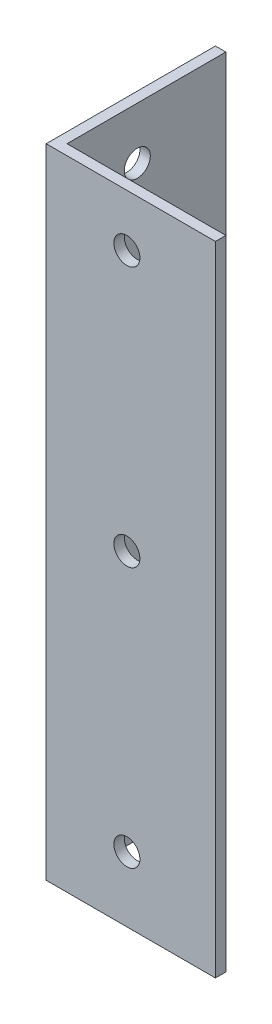
ISO-10303-21;
HEADER;
FILE_DESCRIPTION(('STEP AP214'),'2;1');
FILE_NAME('part.step','',(''),(''),'','','');
FILE_SCHEMA(('AUTOMOTIVE_DESIGN { 1 0 10303 214 1 1 1 1 }'));
ENDSEC;
DATA;
#1=APPLICATION_CONTEXT('core data for automotive mechanical design processes');
#2=APPLICATION_PROTOCOL_DEFINITION('international standard','automotive_design',2000,#1);
#3=PRODUCT_CONTEXT('',#1,'mechanical');
#4=PRODUCT('Part','Part','',(#3));
#5=PRODUCT_RELATED_PRODUCT_CATEGORY('part','',(#4));
#6=PRODUCT_DEFINITION_FORMATION('','',#4);
#7=PRODUCT_DEFINITION_CONTEXT('part definition',#1,'design');
#8=PRODUCT_DEFINITION('design','',#6,#7);
#9=PRODUCT_DEFINITION_SHAPE('','',#8);
#10=(LENGTH_UNIT() NAMED_UNIT(*) SI_UNIT(.MILLI.,.METRE.));
#11=(NAMED_UNIT(*) PLANE_ANGLE_UNIT() SI_UNIT($,.RADIAN.));
#12=(NAMED_UNIT(*) SI_UNIT($,.STERADIAN.) SOLID_ANGLE_UNIT());
#13=UNCERTAINTY_MEASURE_WITH_UNIT(LENGTH_MEASURE(1.E-05),#10,'distance_accuracy_value','');
#14=(GEOMETRIC_REPRESENTATION_CONTEXT(3) GLOBAL_UNCERTAINTY_ASSIGNED_CONTEXT((#13)) GLOBAL_UNIT_ASSIGNED_CONTEXT((#10,
#11,#12)) REPRESENTATION_CONTEXT('',''));
#15=CARTESIAN_POINT('',(0.,0.,0.));
#16=DIRECTION('',(0.,0.,1.));
#17=DIRECTION('',(1.,0.,0.));
#18=AXIS2_PLACEMENT_3D('',#15,#16,#17);
#19=CARTESIAN_POINT('',(4.,245.,0.));
#20=DIRECTION('',(-1.,0.,0.));
#21=DIRECTION('',(0.,0.,1.));
#22=AXIS2_PLACEMENT_3D('',#19,#20,#21);
#23=PLANE('',#22);
#24=CARTESIAN_POINT('',(4.,125.,-30.9999999999961));
#25=DIRECTION('',(-1.,0.,0.));
#26=DIRECTION('',(0.,0.,1.));
#27=AXIS2_PLACEMENT_3D('',#24,#25,#26);
#28=CIRCLE('',#27,4.99999999999999);
#29=CARTESIAN_POINT('',(4.,125.,-25.9999999999961));
#30=VERTEX_POINT('',#29);
#31=EDGE_CURVE('E188',#30,#30,#28,.T.);
#32=ORIENTED_EDGE('',*,*,#31,.T.);
#33=EDGE_LOOP('',(#32));
#34=FACE_BOUND('',#33,.T.);
#35=CARTESIAN_POINT('',(4.,25.,-30.9999999999922));
#36=DIRECTION('',(-1.,0.,0.));
#37=DIRECTION('',(0.,0.,1.));
#38=AXIS2_PLACEMENT_3D('',#35,#36,#37);
#39=CIRCLE('',#38,5.);
#40=CARTESIAN_POINT('',(4.,25.,-25.9999999999922));
#41=VERTEX_POINT('',#40);
#42=EDGE_CURVE('E192',#41,#41,#39,.T.);
#43=ORIENTED_EDGE('',*,*,#42,.T.);
#44=EDGE_LOOP('',(#43));
#45=FACE_BOUND('',#44,.T.);
#46=CARTESIAN_POINT('',(4.,225.,-31.));
#47=DIRECTION('',(-1.,0.,0.));
#48=DIRECTION('',(0.,0.,1.));
#49=AXIS2_PLACEMENT_3D('',#46,#47,#48);
#50=CIRCLE('',#49,5.);
#51=CARTESIAN_POINT('',(4.,225.,-26.));
#52=VERTEX_POINT('',#51);
#53=EDGE_CURVE('E149',#52,#52,#50,.T.);
#54=ORIENTED_EDGE('',*,*,#53,.T.);
#55=EDGE_LOOP('',(#54));
#56=FACE_BOUND('',#55,.T.);
#57=DIRECTION('',(0.,0.,-1.));
#58=VECTOR('',#57,1.);
#59=CARTESIAN_POINT('',(4.,0.,0.));
#60=LINE('',#59,#58);
#61=CARTESIAN_POINT('',(4.,0.,-4.));
#62=VERTEX_POINT('',#61);
#63=CARTESIAN_POINT('',(4.,0.,-65.));
#64=VERTEX_POINT('',#63);
#65=EDGE_CURVE('E117',#62,#64,#60,.T.);
#66=ORIENTED_EDGE('',*,*,#65,.T.);
#67=DIRECTION('',(0.,-1.,0.));
#68=VECTOR('',#67,1.);
#69=CARTESIAN_POINT('',(4.,245.,-65.));
#70=LINE('',#69,#68);
#71=CARTESIAN_POINT('',(4.,245.,-65.));
#72=VERTEX_POINT('',#71);
#73=EDGE_CURVE('E11',#72,#64,#70,.T.);
#74=ORIENTED_EDGE('',*,*,#73,.F.);
#75=DIRECTION('',(0.,0.,-1.));
#76=VECTOR('',#75,1.);
#77=CARTESIAN_POINT('',(4.,245.,0.));
#78=LINE('',#77,#76);
#79=CARTESIAN_POINT('',(4.,245.,-4.));
#80=VERTEX_POINT('',#79);
#81=EDGE_CURVE('E82',#80,#72,#78,.T.);
#82=ORIENTED_EDGE('',*,*,#81,.F.);
#83=DIRECTION('',(0.,-1.,0.));
#84=VECTOR('',#83,1.);
#85=CARTESIAN_POINT('',(4.,245.,-4.));
#86=LINE('',#85,#84);
#87=EDGE_CURVE('E113',#80,#62,#86,.T.);
#88=ORIENTED_EDGE('',*,*,#87,.T.);
#89=EDGE_LOOP('',(#66,#74,#82,#88));
#90=FACE_BOUND('',#89,.T.);
#91=ADVANCED_FACE('F34',(#34,#45,#56,#90),#23,.F.);
#92=CARTESIAN_POINT('',(0.,245.,-65.));
#93=DIRECTION('',(0.,0.,-1.));
#94=DIRECTION('',(-1.,0.,0.));
#95=AXIS2_PLACEMENT_3D('',#92,#93,#94);
#96=PLANE('',#95);
#97=DIRECTION('',(1.,0.,0.));
#98=VECTOR('',#97,1.);
#99=CARTESIAN_POINT('',(0.,0.,-65.));
#100=LINE('',#99,#98);
#101=CARTESIAN_POINT('',(0.,0.,-65.));
#102=VERTEX_POINT('',#101);
#103=EDGE_CURVE('E120',#102,#64,#100,.T.);
#104=ORIENTED_EDGE('',*,*,#103,.F.);
#105=DIRECTION('',(0.,-1.,0.));
#106=VECTOR('',#105,1.);
#107=CARTESIAN_POINT('',(0.,245.,-65.));
#108=LINE('',#107,#106);
#109=CARTESIAN_POINT('',(0.,245.,-65.));
#110=VERTEX_POINT('',#109);
#111=EDGE_CURVE('E43',#110,#102,#108,.T.);
#112=ORIENTED_EDGE('',*,*,#111,.F.);
#113=DIRECTION('',(1.,0.,0.));
#114=VECTOR('',#113,1.);
#115=CARTESIAN_POINT('',(0.,245.,-65.));
#116=LINE('',#115,#114);
#117=EDGE_CURVE('E157',#110,#72,#116,.T.);
#118=ORIENTED_EDGE('',*,*,#117,.T.);
#119=ORIENTED_EDGE('',*,*,#73,.T.);
#120=EDGE_LOOP('',(#104,#112,#118,#119));
#121=FACE_BOUND('',#120,.T.);
#122=ADVANCED_FACE('F179',(#121),#96,.T.);
#123=CARTESIAN_POINT('',(0.,245.,0.));
#124=DIRECTION('',(-1.,0.,0.));
#125=DIRECTION('',(0.,0.,1.));
#126=AXIS2_PLACEMENT_3D('',#123,#124,#125);
#127=PLANE('',#126);
#128=CARTESIAN_POINT('',(0.,125.,-30.9999999999961));
#129=DIRECTION('',(-1.,0.,0.));
#130=DIRECTION('',(0.,0.,1.));
#131=AXIS2_PLACEMENT_3D('',#128,#129,#130);
#132=CIRCLE('',#131,4.99999999999999);
#133=CARTESIAN_POINT('',(0.,125.,-25.9999999999961));
#134=VERTEX_POINT('',#133);
#135=EDGE_CURVE('E203',#134,#134,#132,.T.);
#136=ORIENTED_EDGE('',*,*,#135,.F.);
#137=EDGE_LOOP('',(#136));
#138=FACE_BOUND('',#137,.T.);
#139=CARTESIAN_POINT('',(0.,25.,-30.9999999999922));
#140=DIRECTION('',(-1.,0.,0.));
#141=DIRECTION('',(0.,0.,1.));
#142=AXIS2_PLACEMENT_3D('',#139,#140,#141);
#143=CIRCLE('',#142,5.);
#144=CARTESIAN_POINT('',(0.,25.,-25.9999999999922));
#145=VERTEX_POINT('',#144);
#146=EDGE_CURVE('E204',#145,#145,#143,.T.);
#147=ORIENTED_EDGE('',*,*,#146,.F.);
#148=EDGE_LOOP('',(#147));
#149=FACE_BOUND('',#148,.T.);
#150=CARTESIAN_POINT('',(0.,225.,-31.));
#151=DIRECTION('',(-1.,0.,0.));
#152=DIRECTION('',(0.,0.,1.));
#153=AXIS2_PLACEMENT_3D('',#150,#151,#152);
#154=CIRCLE('',#153,5.);
#155=CARTESIAN_POINT('',(0.,225.,-26.));
#156=VERTEX_POINT('',#155);
#157=EDGE_CURVE('E196',#156,#156,#154,.T.);
#158=ORIENTED_EDGE('',*,*,#157,.F.);
#159=EDGE_LOOP('',(#158));
#160=FACE_BOUND('',#159,.T.);
#161=DIRECTION('',(0.,0.,-1.));
#162=VECTOR('',#161,1.);
#163=CARTESIAN_POINT('',(0.,0.,0.));
#164=LINE('',#163,#162);
#165=CARTESIAN_POINT('',(0.,0.,0.));
#166=VERTEX_POINT('',#165);
#167=EDGE_CURVE('E124',#166,#102,#164,.T.);
#168=ORIENTED_EDGE('',*,*,#167,.F.);
#169=DIRECTION('',(0.,-1.,0.));
#170=VECTOR('',#169,1.);
#171=CARTESIAN_POINT('',(0.,245.,0.));
#172=LINE('',#171,#170);
#173=CARTESIAN_POINT('',(0.,245.,0.));
#174=VERTEX_POINT('',#173);
#175=EDGE_CURVE('E103',#174,#166,#172,.T.);
#176=ORIENTED_EDGE('',*,*,#175,.F.);
#177=DIRECTION('',(0.,0.,-1.));
#178=VECTOR('',#177,1.);
#179=CARTESIAN_POINT('',(0.,245.,0.));
#180=LINE('',#179,#178);
#181=EDGE_CURVE('E109',#174,#110,#180,.T.);
#182=ORIENTED_EDGE('',*,*,#181,.T.);
#183=ORIENTED_EDGE('',*,*,#111,.T.);
#184=EDGE_LOOP('',(#168,#176,#182,#183));
#185=FACE_BOUND('',#184,.T.);
#186=ADVANCED_FACE('F161',(#138,#149,#160,#185),#127,.T.);
#187=CARTESIAN_POINT('',(0.,245.,0.));
#188=DIRECTION('',(0.,0.,1.));
#189=DIRECTION('',(1.,0.,0.));
#190=AXIS2_PLACEMENT_3D('',#187,#188,#189);
#191=PLANE('',#190);
#192=CARTESIAN_POINT('',(31.0000000000039,125.,0.));
#193=DIRECTION('',(0.,0.,1.));
#194=DIRECTION('',(1.,0.,0.));
#195=AXIS2_PLACEMENT_3D('',#192,#193,#194);
#196=CIRCLE('',#195,5.00000000000001);
#197=CARTESIAN_POINT('',(36.0000000000039,125.,0.));
#198=VERTEX_POINT('',#197);
#199=EDGE_CURVE('E139',#198,#198,#196,.T.);
#200=ORIENTED_EDGE('',*,*,#199,.F.);
#201=EDGE_LOOP('',(#200));
#202=FACE_BOUND('',#201,.T.);
#203=CARTESIAN_POINT('',(31.0000000000078,25.,0.));
#204=DIRECTION('',(0.,0.,1.));
#205=DIRECTION('',(1.,0.,0.));
#206=AXIS2_PLACEMENT_3D('',#203,#204,#205);
#207=CIRCLE('',#206,5.);
#208=CARTESIAN_POINT('',(36.0000000000078,25.,0.));
#209=VERTEX_POINT('',#208);
#210=EDGE_CURVE('E144',#209,#209,#207,.T.);
#211=ORIENTED_EDGE('',*,*,#210,.F.);
#212=EDGE_LOOP('',(#211));
#213=FACE_BOUND('',#212,.T.);
#214=CARTESIAN_POINT('',(31.,225.,0.));
#215=DIRECTION('',(0.,0.,1.));
#216=DIRECTION('',(1.,0.,0.));
#217=AXIS2_PLACEMENT_3D('',#214,#215,#216);
#218=CIRCLE('',#217,5.);
#219=CARTESIAN_POINT('',(36.,225.,0.));
#220=VERTEX_POINT('',#219);
#221=EDGE_CURVE('E136',#220,#220,#218,.T.);
#222=ORIENTED_EDGE('',*,*,#221,.F.);
#223=EDGE_LOOP('',(#222));
#224=FACE_BOUND('',#223,.T.);
#225=DIRECTION('',(-1.,0.,0.));
#226=VECTOR('',#225,1.);
#227=CARTESIAN_POINT('',(0.,0.,0.));
#228=LINE('',#227,#226);
#229=CARTESIAN_POINT('',(65.,0.,0.));
#230=VERTEX_POINT('',#229);
#231=EDGE_CURVE('E98',#230,#166,#228,.T.);
#232=ORIENTED_EDGE('',*,*,#231,.F.);
#233=DIRECTION('',(0.,-1.,0.));
#234=VECTOR('',#233,1.);
#235=CARTESIAN_POINT('',(65.,245.,0.));
#236=LINE('',#235,#234);
#237=CARTESIAN_POINT('',(65.,245.,0.));
#238=VERTEX_POINT('',#237);
#239=EDGE_CURVE('E93',#238,#230,#236,.T.);
#240=ORIENTED_EDGE('',*,*,#239,.F.);
#241=DIRECTION('',(-1.,0.,0.));
#242=VECTOR('',#241,1.);
#243=CARTESIAN_POINT('',(0.,245.,0.));
#244=LINE('',#243,#242);
#245=EDGE_CURVE('E96',#238,#174,#244,.T.);
#246=ORIENTED_EDGE('',*,*,#245,.T.);
#247=ORIENTED_EDGE('',*,*,#175,.T.);
#248=EDGE_LOOP('',(#232,#240,#246,#247));
#249=FACE_BOUND('',#248,.T.);
#250=ADVANCED_FACE('F95',(#202,#213,#224,#249),#191,.T.);
#251=CARTESIAN_POINT('',(65.,245.,-4.));
#252=DIRECTION('',(1.,0.,0.));
#253=DIRECTION('',(0.,0.,-1.));
#254=AXIS2_PLACEMENT_3D('',#251,#252,#253);
#255=PLANE('',#254);
#256=DIRECTION('',(0.,0.,1.));
#257=VECTOR('',#256,1.);
#258=CARTESIAN_POINT('',(65.,0.,-4.));
#259=LINE('',#258,#257);
#260=CARTESIAN_POINT('',(65.,0.,-4.));
#261=VERTEX_POINT('',#260);
#262=EDGE_CURVE('E128',#261,#230,#259,.T.);
#263=ORIENTED_EDGE('',*,*,#262,.F.);
#264=DIRECTION('',(0.,-1.,0.));
#265=VECTOR('',#264,1.);
#266=CARTESIAN_POINT('',(65.,245.,-4.));
#267=LINE('',#266,#265);
#268=CARTESIAN_POINT('',(65.,245.,-4.));
#269=VERTEX_POINT('',#268);
#270=EDGE_CURVE('E73',#269,#261,#267,.T.);
#271=ORIENTED_EDGE('',*,*,#270,.F.);
#272=DIRECTION('',(0.,0.,1.));
#273=VECTOR('',#272,1.);
#274=CARTESIAN_POINT('',(65.,245.,-4.));
#275=LINE('',#274,#273);
#276=EDGE_CURVE('E107',#269,#238,#275,.T.);
#277=ORIENTED_EDGE('',*,*,#276,.T.);
#278=ORIENTED_EDGE('',*,*,#239,.T.);
#279=EDGE_LOOP('',(#263,#271,#277,#278));
#280=FACE_BOUND('',#279,.T.);
#281=ADVANCED_FACE('F111',(#280),#255,.T.);
#282=CARTESIAN_POINT('',(0.,245.,-4.));
#283=DIRECTION('',(0.,0.,1.));
#284=DIRECTION('',(1.,0.,0.));
#285=AXIS2_PLACEMENT_3D('',#282,#283,#284);
#286=PLANE('',#285);
#287=CARTESIAN_POINT('',(31.0000000000039,125.,-4.));
#288=DIRECTION('',(0.,0.,1.));
#289=DIRECTION('',(1.,0.,0.));
#290=AXIS2_PLACEMENT_3D('',#287,#288,#289);
#291=CIRCLE('',#290,5.00000000000001);
#292=CARTESIAN_POINT('',(36.0000000000039,125.,-4.));
#293=VERTEX_POINT('',#292);
#294=EDGE_CURVE('E37',#293,#293,#291,.T.);
#295=ORIENTED_EDGE('',*,*,#294,.T.);
#296=EDGE_LOOP('',(#295));
#297=FACE_BOUND('',#296,.T.);
#298=CARTESIAN_POINT('',(31.0000000000078,25.,-4.));
#299=DIRECTION('',(0.,0.,1.));
#300=DIRECTION('',(1.,0.,0.));
#301=AXIS2_PLACEMENT_3D('',#298,#299,#300);
#302=CIRCLE('',#301,5.);
#303=CARTESIAN_POINT('',(36.0000000000078,25.,-4.));
#304=VERTEX_POINT('',#303);
#305=EDGE_CURVE('E137',#304,#304,#302,.T.);
#306=ORIENTED_EDGE('',*,*,#305,.T.);
#307=EDGE_LOOP('',(#306));
#308=FACE_BOUND('',#307,.T.);
#309=CARTESIAN_POINT('',(31.,225.,-4.));
#310=DIRECTION('',(0.,0.,1.));
#311=DIRECTION('',(1.,0.,0.));
#312=AXIS2_PLACEMENT_3D('',#309,#310,#311);
#313=CIRCLE('',#312,5.);
#314=CARTESIAN_POINT('',(36.,225.,-4.));
#315=VERTEX_POINT('',#314);
#316=EDGE_CURVE('E121',#315,#315,#313,.T.);
#317=ORIENTED_EDGE('',*,*,#316,.T.);
#318=EDGE_LOOP('',(#317));
#319=FACE_BOUND('',#318,.T.);
#320=DIRECTION('',(1.,0.,0.));
#321=VECTOR('',#320,1.);
#322=CARTESIAN_POINT('',(0.,0.,-4.));
#323=LINE('',#322,#321);
#324=EDGE_CURVE('E76',#261,#62,#323,.F.);
#325=ORIENTED_EDGE('',*,*,#324,.T.);
#326=ORIENTED_EDGE('',*,*,#87,.F.);
#327=DIRECTION('',(1.,0.,0.));
#328=VECTOR('',#327,1.);
#329=CARTESIAN_POINT('',(0.,245.,-4.));
#330=LINE('',#329,#328);
#331=EDGE_CURVE('E52',#269,#80,#330,.F.);
#332=ORIENTED_EDGE('',*,*,#331,.F.);
#333=ORIENTED_EDGE('',*,*,#270,.T.);
#334=EDGE_LOOP('',(#325,#326,#332,#333));
#335=FACE_BOUND('',#334,.T.);
#336=ADVANCED_FACE('F167',(#297,#308,#319,#335),#286,.F.);
#337=CARTESIAN_POINT('',(0.,245.,0.));
#338=DIRECTION('',(0.,-1.,0.));
#339=DIRECTION('',(-1.,0.,0.));
#340=AXIS2_PLACEMENT_3D('',#337,#338,#339);
#341=PLANE('',#340);
#342=ORIENTED_EDGE('',*,*,#81,.T.);
#343=ORIENTED_EDGE('',*,*,#117,.F.);
#344=ORIENTED_EDGE('',*,*,#181,.F.);
#345=ORIENTED_EDGE('',*,*,#245,.F.);
#346=ORIENTED_EDGE('',*,*,#276,.F.);
#347=ORIENTED_EDGE('',*,*,#331,.T.);
#348=EDGE_LOOP('',(#342,#343,#344,#345,#346,#347));
#349=FACE_BOUND('',#348,.T.);
#350=ADVANCED_FACE('F106',(#349),#341,.F.);
#351=CARTESIAN_POINT('',(0.,0.,0.));
#352=DIRECTION('',(0.,-1.,0.));
#353=DIRECTION('',(-1.,0.,0.));
#354=AXIS2_PLACEMENT_3D('',#351,#352,#353);
#355=PLANE('',#354);
#356=ORIENTED_EDGE('',*,*,#65,.F.);
#357=ORIENTED_EDGE('',*,*,#324,.F.);
#358=ORIENTED_EDGE('',*,*,#262,.T.);
#359=ORIENTED_EDGE('',*,*,#231,.T.);
#360=ORIENTED_EDGE('',*,*,#167,.T.);
#361=ORIENTED_EDGE('',*,*,#103,.T.);
#362=EDGE_LOOP('',(#356,#357,#358,#359,#360,#361));
#363=FACE_BOUND('',#362,.T.);
#364=ADVANCED_FACE('F165',(#363),#355,.T.);
#365=CARTESIAN_POINT('',(31.,225.,-10.));
#366=DIRECTION('',(0.,0.,1.));
#367=DIRECTION('',(1.,0.,0.));
#368=AXIS2_PLACEMENT_3D('',#365,#366,#367);
#369=CYLINDRICAL_SURFACE('',#368,5.);
#370=ORIENTED_EDGE('',*,*,#221,.T.);
#371=EDGE_LOOP('',(#370));
#372=FACE_BOUND('',#371,.T.);
#373=ORIENTED_EDGE('',*,*,#316,.F.);
#374=EDGE_LOOP('',(#373));
#375=FACE_BOUND('',#374,.T.);
#376=ADVANCED_FACE('F237',(#372,#375),#369,.F.);
#377=CARTESIAN_POINT('',(31.0000000000078,25.,-10.));
#378=DIRECTION('',(0.,0.,1.));
#379=DIRECTION('',(1.,0.,0.));
#380=AXIS2_PLACEMENT_3D('',#377,#378,#379);
#381=CYLINDRICAL_SURFACE('',#380,5.);
#382=ORIENTED_EDGE('',*,*,#210,.T.);
#383=EDGE_LOOP('',(#382));
#384=FACE_BOUND('',#383,.T.);
#385=ORIENTED_EDGE('',*,*,#305,.F.);
#386=EDGE_LOOP('',(#385));
#387=FACE_BOUND('',#386,.T.);
#388=ADVANCED_FACE('F234',(#384,#387),#381,.F.);
#389=CARTESIAN_POINT('',(31.0000000000039,125.,-10.));
#390=DIRECTION('',(0.,0.,1.));
#391=DIRECTION('',(1.,0.,0.));
#392=AXIS2_PLACEMENT_3D('',#389,#390,#391);
#393=CYLINDRICAL_SURFACE('',#392,5.00000000000001);
#394=ORIENTED_EDGE('',*,*,#199,.T.);
#395=EDGE_LOOP('',(#394));
#396=FACE_BOUND('',#395,.T.);
#397=ORIENTED_EDGE('',*,*,#294,.F.);
#398=EDGE_LOOP('',(#397));
#399=FACE_BOUND('',#398,.T.);
#400=ADVANCED_FACE('F229',(#396,#399),#393,.F.);
#401=CARTESIAN_POINT('',(10.,225.,-31.));
#402=DIRECTION('',(-1.,0.,0.));
#403=DIRECTION('',(0.,0.,1.));
#404=AXIS2_PLACEMENT_3D('',#401,#402,#403);
#405=CYLINDRICAL_SURFACE('',#404,5.);
#406=ORIENTED_EDGE('',*,*,#157,.T.);
#407=EDGE_LOOP('',(#406));
#408=FACE_BOUND('',#407,.T.);
#409=ORIENTED_EDGE('',*,*,#53,.F.);
#410=EDGE_LOOP('',(#409));
#411=FACE_BOUND('',#410,.T.);
#412=ADVANCED_FACE('F222',(#408,#411),#405,.F.);
#413=CARTESIAN_POINT('',(10.,25.,-30.9999999999922));
#414=DIRECTION('',(-1.,0.,0.));
#415=DIRECTION('',(0.,0.,1.));
#416=AXIS2_PLACEMENT_3D('',#413,#414,#415);
#417=CYLINDRICAL_SURFACE('',#416,5.);
#418=ORIENTED_EDGE('',*,*,#146,.T.);
#419=EDGE_LOOP('',(#418));
#420=FACE_BOUND('',#419,.T.);
#421=ORIENTED_EDGE('',*,*,#42,.F.);
#422=EDGE_LOOP('',(#421));
#423=FACE_BOUND('',#422,.T.);
#424=ADVANCED_FACE('F219',(#420,#423),#417,.F.);
#425=CARTESIAN_POINT('',(10.,125.,-30.9999999999961));
#426=DIRECTION('',(-1.,0.,0.));
#427=DIRECTION('',(0.,0.,1.));
#428=AXIS2_PLACEMENT_3D('',#425,#426,#427);
#429=CYLINDRICAL_SURFACE('',#428,4.99999999999999);
#430=ORIENTED_EDGE('',*,*,#135,.T.);
#431=EDGE_LOOP('',(#430));
#432=FACE_BOUND('',#431,.T.);
#433=ORIENTED_EDGE('',*,*,#31,.F.);
#434=EDGE_LOOP('',(#433));
#435=FACE_BOUND('',#434,.T.);
#436=ADVANCED_FACE('F210',(#432,#435),#429,.F.);
#437=CLOSED_SHELL('',(#91,#122,#186,#250,#281,#336,#350,#364,#376,#388,#400,#412,#424,#436));
#438=MANIFOLD_SOLID_BREP('B2',#437);
#439=ADVANCED_BREP_SHAPE_REPRESENTATION('',(#18,#438),#14);
#440=SHAPE_DEFINITION_REPRESENTATION(#9,#439);
ENDSEC;
END-ISO-10303-21;
